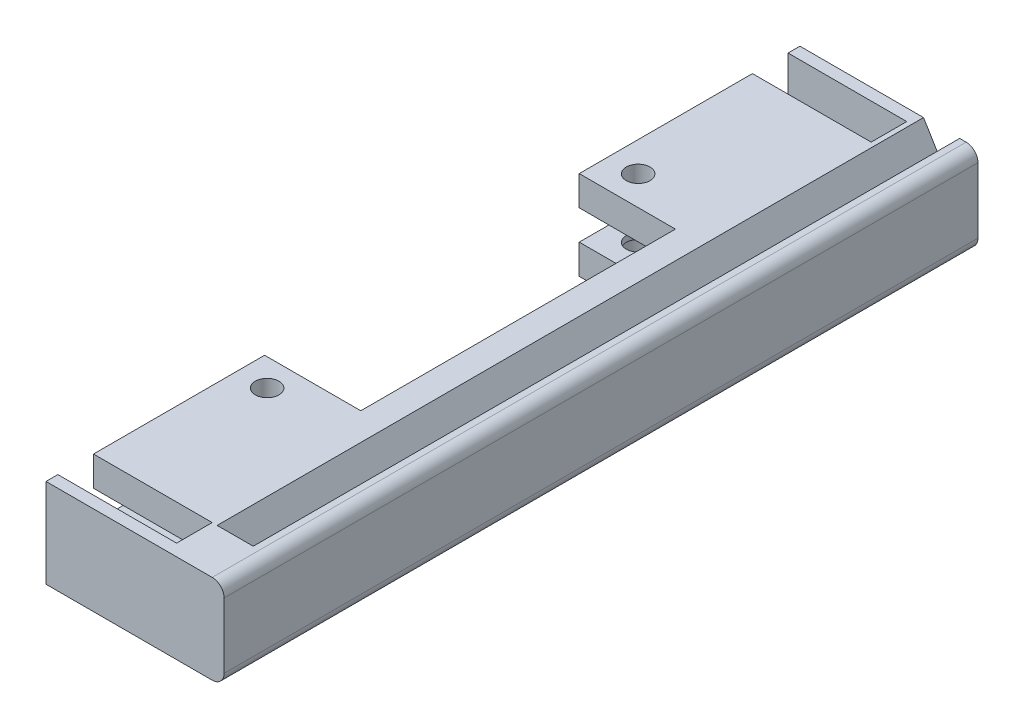
ISO-10303-21;
HEADER;
FILE_DESCRIPTION(('STEP AP214'),'2;1');
FILE_NAME('part.step','',(''),(''),'','','');
FILE_SCHEMA(('AUTOMOTIVE_DESIGN { 1 0 10303 214 1 1 1 1 }'));
ENDSEC;
DATA;
#1=APPLICATION_CONTEXT('core data for automotive mechanical design processes');
#2=APPLICATION_PROTOCOL_DEFINITION('international standard','automotive_design',2000,#1);
#3=PRODUCT_CONTEXT('',#1,'mechanical');
#4=PRODUCT('Part','Part','',(#3));
#5=PRODUCT_RELATED_PRODUCT_CATEGORY('part','',(#4));
#6=PRODUCT_DEFINITION_FORMATION('','',#4);
#7=PRODUCT_DEFINITION_CONTEXT('part definition',#1,'design');
#8=PRODUCT_DEFINITION('design','',#6,#7);
#9=PRODUCT_DEFINITION_SHAPE('','',#8);
#10=(LENGTH_UNIT() NAMED_UNIT(*) SI_UNIT(.MILLI.,.METRE.));
#11=(NAMED_UNIT(*) PLANE_ANGLE_UNIT() SI_UNIT($,.RADIAN.));
#12=(NAMED_UNIT(*) SI_UNIT($,.STERADIAN.) SOLID_ANGLE_UNIT());
#13=UNCERTAINTY_MEASURE_WITH_UNIT(LENGTH_MEASURE(1.E-05),#10,'distance_accuracy_value','');
#14=(GEOMETRIC_REPRESENTATION_CONTEXT(3) GLOBAL_UNCERTAINTY_ASSIGNED_CONTEXT((#13)) GLOBAL_UNIT_ASSIGNED_CONTEXT((#10,
#11,#12)) REPRESENTATION_CONTEXT('',''));
#15=CARTESIAN_POINT('',(0.,0.,0.));
#16=DIRECTION('',(0.,0.,1.));
#17=DIRECTION('',(1.,0.,0.));
#18=AXIS2_PLACEMENT_3D('',#15,#16,#17);
#19=CARTESIAN_POINT('',(0.,0.,111.));
#20=DIRECTION('',(-1.,0.,0.));
#21=DIRECTION('',(0.,0.,1.));
#22=AXIS2_PLACEMENT_3D('',#19,#20,#21);
#23=PLANE('',#22);
#24=DIRECTION('',(0.,-1.,0.));
#25=VECTOR('',#24,1.);
#26=CARTESIAN_POINT('',(0.,20.,82.1749098757519));
#27=LINE('',#26,#25);
#28=CARTESIAN_POINT('',(0.,15.,82.1749098757519));
#29=VERTEX_POINT('',#28);
#30=CARTESIAN_POINT('',(0.,10.,82.1749098757519));
#31=VERTEX_POINT('',#30);
#32=EDGE_CURVE('E279',#29,#31,#27,.T.);
#33=ORIENTED_EDGE('',*,*,#32,.T.);
#34=DIRECTION('',(0.,0.,-1.));
#35=VECTOR('',#34,1.);
#36=CARTESIAN_POINT('',(0.,10.,111.));
#37=LINE('',#36,#35);
#38=CARTESIAN_POINT('',(0.,10.,111.));
#39=VERTEX_POINT('',#38);
#40=EDGE_CURVE('E504',#39,#31,#37,.T.);
#41=ORIENTED_EDGE('',*,*,#40,.F.);
#42=DIRECTION('',(0.,1.,0.));
#43=VECTOR('',#42,1.);
#44=CARTESIAN_POINT('',(0.,0.,111.));
#45=LINE('',#44,#43);
#46=CARTESIAN_POINT('',(0.,15.,111.));
#47=VERTEX_POINT('',#46);
#48=EDGE_CURVE('E461',#39,#47,#45,.T.);
#49=ORIENTED_EDGE('',*,*,#48,.T.);
#50=DIRECTION('',(0.,0.,-1.));
#51=VECTOR('',#50,1.);
#52=CARTESIAN_POINT('',(0.,15.,111.));
#53=LINE('',#52,#51);
#54=EDGE_CURVE('E509',#47,#29,#53,.T.);
#55=ORIENTED_EDGE('',*,*,#54,.T.);
#56=EDGE_LOOP('',(#33,#41,#49,#55));
#57=FACE_BOUND('',#56,.T.);
#58=ADVANCED_FACE('F43',(#57),#23,.T.);
#59=CARTESIAN_POINT('',(0.,0.,111.));
#60=DIRECTION('',(-1.,0.,0.));
#61=DIRECTION('',(0.,0.,1.));
#62=AXIS2_PLACEMENT_3D('',#59,#60,#61);
#63=PLANE('',#62);
#64=CARTESIAN_POINT('',(0.,5.,82.1749098757519));
#65=VERTEX_POINT('',#64);
#66=CARTESIAN_POINT('',(0.,0.,82.1749098757519));
#67=VERTEX_POINT('',#66);
#68=EDGE_CURVE('E275',#65,#67,#27,.T.);
#69=ORIENTED_EDGE('',*,*,#68,.T.);
#70=DIRECTION('',(0.,0.,-1.));
#71=VECTOR('',#70,1.);
#72=CARTESIAN_POINT('',(0.,0.,111.));
#73=LINE('',#72,#71);
#74=CARTESIAN_POINT('',(0.,0.,119.));
#75=VERTEX_POINT('',#74);
#76=EDGE_CURVE('E486',#75,#67,#73,.T.);
#77=ORIENTED_EDGE('',*,*,#76,.F.);
#78=DIRECTION('',(0.,-1.,0.));
#79=VECTOR('',#78,1.);
#80=CARTESIAN_POINT('',(0.,0.,119.));
#81=LINE('',#80,#79);
#82=CARTESIAN_POINT('',(0.,15.,119.));
#83=VERTEX_POINT('',#82);
#84=EDGE_CURVE('E408',#83,#75,#81,.T.);
#85=ORIENTED_EDGE('',*,*,#84,.F.);
#86=DIRECTION('',(0.,0.,-1.));
#87=VECTOR('',#86,1.);
#88=CARTESIAN_POINT('',(0.,15.,119.));
#89=LINE('',#88,#87);
#90=CARTESIAN_POINT('',(0.,15.,117.));
#91=VERTEX_POINT('',#90);
#92=EDGE_CURVE('E432',#83,#91,#89,.T.);
#93=ORIENTED_EDGE('',*,*,#92,.T.);
#94=DIRECTION('',(0.,-1.,0.));
#95=VECTOR('',#94,1.);
#96=CARTESIAN_POINT('',(0.,0.,117.));
#97=LINE('',#96,#95);
#98=CARTESIAN_POINT('',(0.,5.,117.));
#99=VERTEX_POINT('',#98);
#100=EDGE_CURVE('E407',#91,#99,#97,.T.);
#101=ORIENTED_EDGE('',*,*,#100,.T.);
#102=DIRECTION('',(0.,0.,-1.));
#103=VECTOR('',#102,1.);
#104=CARTESIAN_POINT('',(0.,5.,111.));
#105=LINE('',#104,#103);
#106=EDGE_CURVE('E491',#99,#65,#105,.T.);
#107=ORIENTED_EDGE('',*,*,#106,.T.);
#108=EDGE_LOOP('',(#69,#77,#85,#93,#101,#107));
#109=FACE_BOUND('',#108,.T.);
#110=ADVANCED_FACE('F531',(#109),#63,.T.);
#111=CARTESIAN_POINT('',(5.,41.,86.75));
#112=DIRECTION('',(0.,-1.,0.));
#113=DIRECTION('',(0.,0.,-1.));
#114=AXIS2_PLACEMENT_3D('',#111,#112,#113);
#115=CYLINDRICAL_SURFACE('',#114,2.);
#116=CARTESIAN_POINT('',(5.,5.,86.75));
#117=DIRECTION('',(0.,1.,0.));
#118=DIRECTION('',(-1.,0.,0.));
#119=AXIS2_PLACEMENT_3D('',#116,#117,#118);
#120=CIRCLE('',#119,2.);
#121=CARTESIAN_POINT('',(3.,5.,86.75));
#122=VERTEX_POINT('',#121);
#123=EDGE_CURVE('E336',#122,#122,#120,.T.);
#124=ORIENTED_EDGE('',*,*,#123,.T.);
#125=EDGE_LOOP('',(#124));
#126=FACE_BOUND('',#125,.T.);
#127=CARTESIAN_POINT('',(5.,4.,86.75));
#128=DIRECTION('',(0.,-1.,0.));
#129=DIRECTION('',(0.,0.,-1.));
#130=AXIS2_PLACEMENT_3D('',#127,#128,#129);
#131=CIRCLE('',#130,2.);
#132=CARTESIAN_POINT('',(5.,4.,84.75));
#133=VERTEX_POINT('',#132);
#134=EDGE_CURVE('E47',#133,#133,#131,.F.);
#135=ORIENTED_EDGE('',*,*,#134,.F.);
#136=EDGE_LOOP('',(#135));
#137=FACE_BOUND('',#136,.T.);
#138=ADVANCED_FACE('F528',(#126,#137),#115,.F.);
#139=CARTESIAN_POINT('',(5.,41.,24.25));
#140=DIRECTION('',(0.,-1.,0.));
#141=DIRECTION('',(0.,0.,-1.));
#142=AXIS2_PLACEMENT_3D('',#139,#140,#141);
#143=CYLINDRICAL_SURFACE('',#142,2.);
#144=CARTESIAN_POINT('',(5.,5.,24.25));
#145=DIRECTION('',(0.,1.,0.));
#146=DIRECTION('',(-1.,0.,0.));
#147=AXIS2_PLACEMENT_3D('',#144,#145,#146);
#148=CIRCLE('',#147,2.);
#149=CARTESIAN_POINT('',(3.,5.,24.25));
#150=VERTEX_POINT('',#149);
#151=EDGE_CURVE('E348',#150,#150,#148,.T.);
#152=ORIENTED_EDGE('',*,*,#151,.T.);
#153=EDGE_LOOP('',(#152));
#154=FACE_BOUND('',#153,.T.);
#155=CARTESIAN_POINT('',(5.,4.,24.25));
#156=DIRECTION('',(0.,-1.,0.));
#157=DIRECTION('',(0.,0.,-1.));
#158=AXIS2_PLACEMENT_3D('',#155,#156,#157);
#159=CIRCLE('',#158,2.);
#160=CARTESIAN_POINT('',(5.,4.,22.25));
#161=VERTEX_POINT('',#160);
#162=EDGE_CURVE('E324',#161,#161,#159,.F.);
#163=ORIENTED_EDGE('',*,*,#162,.F.);
#164=EDGE_LOOP('',(#163));
#165=FACE_BOUND('',#164,.T.);
#166=ADVANCED_FACE('F530',(#154,#165),#143,.F.);
#167=CARTESIAN_POINT('',(0.,0.,0.));
#168=DIRECTION('',(0.,0.,1.));
#169=DIRECTION('',(1.,0.,0.));
#170=AXIS2_PLACEMENT_3D('',#167,#168,#169);
#171=PLANE('',#170);
#172=DIRECTION('',(0.,1.,0.));
#173=VECTOR('',#172,1.);
#174=CARTESIAN_POINT('',(20.,0.,0.));
#175=LINE('',#174,#173);
#176=CARTESIAN_POINT('',(20.,10.,0.));
#177=VERTEX_POINT('',#176);
#178=CARTESIAN_POINT('',(20.,15.,0.));
#179=VERTEX_POINT('',#178);
#180=EDGE_CURVE('E11',#177,#179,#175,.T.);
#181=ORIENTED_EDGE('',*,*,#180,.F.);
#182=DIRECTION('',(1.,0.,0.));
#183=VECTOR('',#182,1.);
#184=CARTESIAN_POINT('',(0.,10.,0.));
#185=LINE('',#184,#183);
#186=CARTESIAN_POINT('',(0.,10.,0.));
#187=VERTEX_POINT('',#186);
#188=EDGE_CURVE('E462',#187,#177,#185,.T.);
#189=ORIENTED_EDGE('',*,*,#188,.F.);
#190=DIRECTION('',(0.,1.,0.));
#191=VECTOR('',#190,1.);
#192=CARTESIAN_POINT('',(0.,0.,0.));
#193=LINE('',#192,#191);
#194=CARTESIAN_POINT('',(0.,15.,0.));
#195=VERTEX_POINT('',#194);
#196=EDGE_CURVE('E473',#187,#195,#193,.T.);
#197=ORIENTED_EDGE('',*,*,#196,.T.);
#198=DIRECTION('',(1.,0.,0.));
#199=VECTOR('',#198,1.);
#200=CARTESIAN_POINT('',(0.,15.,0.));
#201=LINE('',#200,#199);
#202=EDGE_CURVE('E456',#195,#179,#201,.T.);
#203=ORIENTED_EDGE('',*,*,#202,.T.);
#204=EDGE_LOOP('',(#181,#189,#197,#203));
#205=FACE_BOUND('',#204,.T.);
#206=ADVANCED_FACE('F539',(#205),#171,.F.);
#207=CARTESIAN_POINT('',(0.,0.,111.));
#208=DIRECTION('',(0.,0.,1.));
#209=DIRECTION('',(1.,0.,0.));
#210=AXIS2_PLACEMENT_3D('',#207,#208,#209);
#211=PLANE('',#210);
#212=DIRECTION('',(1.,0.,0.));
#213=VECTOR('',#212,1.);
#214=CARTESIAN_POINT('',(0.,10.,111.));
#215=LINE('',#214,#213);
#216=CARTESIAN_POINT('',(20.,10.,111.));
#217=VERTEX_POINT('',#216);
#218=EDGE_CURVE('E466',#39,#217,#215,.T.);
#219=ORIENTED_EDGE('',*,*,#218,.T.);
#220=DIRECTION('',(0.,1.,0.));
#221=VECTOR('',#220,1.);
#222=CARTESIAN_POINT('',(20.,0.,111.));
#223=LINE('',#222,#221);
#224=CARTESIAN_POINT('',(20.,15.,111.));
#225=VERTEX_POINT('',#224);
#226=EDGE_CURVE('E53',#217,#225,#223,.T.);
#227=ORIENTED_EDGE('',*,*,#226,.T.);
#228=DIRECTION('',(1.,0.,0.));
#229=VECTOR('',#228,1.);
#230=CARTESIAN_POINT('',(0.,15.,111.));
#231=LINE('',#230,#229);
#232=EDGE_CURVE('E457',#47,#225,#231,.T.);
#233=ORIENTED_EDGE('',*,*,#232,.F.);
#234=ORIENTED_EDGE('',*,*,#48,.F.);
#235=EDGE_LOOP('',(#219,#227,#233,#234));
#236=FACE_BOUND('',#235,.T.);
#237=ADVANCED_FACE('F689',(#236),#211,.T.);
#238=CARTESIAN_POINT('',(30.,0.,111.));
#239=DIRECTION('',(1.,0.,0.));
#240=DIRECTION('',(0.,0.,-1.));
#241=AXIS2_PLACEMENT_3D('',#238,#239,#240);
#242=PLANE('',#241);
#243=DIRECTION('',(0.,0.,-1.));
#244=VECTOR('',#243,1.);
#245=CARTESIAN_POINT('',(30.,2.,111.));
#246=LINE('',#245,#244);
#247=CARTESIAN_POINT('',(30.,2.,119.));
#248=VERTEX_POINT('',#247);
#249=CARTESIAN_POINT('',(30.,2.,-8.));
#250=VERTEX_POINT('',#249);
#251=EDGE_CURVE('E470',#248,#250,#246,.T.);
#252=ORIENTED_EDGE('',*,*,#251,.T.);
#253=DIRECTION('',(0.,-1.,0.));
#254=VECTOR('',#253,1.);
#255=CARTESIAN_POINT('',(30.,0.,-8.));
#256=LINE('',#255,#254);
#257=CARTESIAN_POINT('',(30.,13.,-8.));
#258=VERTEX_POINT('',#257);
#259=EDGE_CURVE('E370',#258,#250,#256,.T.);
#260=ORIENTED_EDGE('',*,*,#259,.F.);
#261=DIRECTION('',(0.,0.,-1.));
#262=VECTOR('',#261,1.);
#263=CARTESIAN_POINT('',(30.,13.,111.));
#264=LINE('',#263,#262);
#265=CARTESIAN_POINT('',(30.,13.,119.));
#266=VERTEX_POINT('',#265);
#267=EDGE_CURVE('E453',#266,#258,#264,.T.);
#268=ORIENTED_EDGE('',*,*,#267,.F.);
#269=DIRECTION('',(0.,1.,0.));
#270=VECTOR('',#269,1.);
#271=CARTESIAN_POINT('',(30.,0.,119.));
#272=LINE('',#271,#270);
#273=EDGE_CURVE('E421',#248,#266,#272,.T.);
#274=ORIENTED_EDGE('',*,*,#273,.F.);
#275=EDGE_LOOP('',(#252,#260,#268,#274));
#276=FACE_BOUND('',#275,.T.);
#277=ADVANCED_FACE('F45',(#276),#242,.T.);
#278=CARTESIAN_POINT('',(28.,13.,111.));
#279=DIRECTION('',(0.,0.,-1.));
#280=DIRECTION('',(-1.,0.,0.));
#281=AXIS2_PLACEMENT_3D('',#278,#279,#280);
#282=CYLINDRICAL_SURFACE('',#281,2.);
#283=ORIENTED_EDGE('',*,*,#267,.T.);
#284=CARTESIAN_POINT('',(28.,13.,-8.));
#285=DIRECTION('',(0.,0.,-1.));
#286=DIRECTION('',(-1.,0.,0.));
#287=AXIS2_PLACEMENT_3D('',#284,#285,#286);
#288=CIRCLE('',#287,2.);
#289=CARTESIAN_POINT('',(28.,15.,-8.));
#290=VERTEX_POINT('',#289);
#291=EDGE_CURVE('E365',#290,#258,#288,.T.);
#292=ORIENTED_EDGE('',*,*,#291,.F.);
#293=DIRECTION('',(0.,0.,-1.));
#294=VECTOR('',#293,1.);
#295=CARTESIAN_POINT('',(28.,15.,111.));
#296=LINE('',#295,#294);
#297=CARTESIAN_POINT('',(28.,15.,119.));
#298=VERTEX_POINT('',#297);
#299=EDGE_CURVE('E513',#298,#290,#296,.T.);
#300=ORIENTED_EDGE('',*,*,#299,.F.);
#301=CARTESIAN_POINT('',(28.,13.,119.));
#302=DIRECTION('',(0.,0.,1.));
#303=DIRECTION('',(1.,0.,0.));
#304=AXIS2_PLACEMENT_3D('',#301,#302,#303);
#305=CIRCLE('',#304,2.);
#306=EDGE_CURVE('E425',#266,#298,#305,.T.);
#307=ORIENTED_EDGE('',*,*,#306,.F.);
#308=EDGE_LOOP('',(#283,#292,#300,#307));
#309=FACE_BOUND('',#308,.T.);
#310=ADVANCED_FACE('F569',(#309),#282,.T.);
#311=CARTESIAN_POINT('',(0.,15.,111.));
#312=DIRECTION('',(0.,1.,0.));
#313=DIRECTION('',(0.,0.,1.));
#314=AXIS2_PLACEMENT_3D('',#311,#312,#313);
#315=PLANE('',#314);
#316=DIRECTION('',(0.,0.,-1.));
#317=VECTOR('',#316,1.);
#318=CARTESIAN_POINT('',(26.9106386641128,15.,120.14136495072));
#319=LINE('',#318,#317);
#320=CARTESIAN_POINT('',(26.9106386641128,15.,111.));
#321=VERTEX_POINT('',#320);
#322=CARTESIAN_POINT('',(26.9106386641128,15.,-8.));
#323=VERTEX_POINT('',#322);
#324=EDGE_CURVE('E251',#321,#323,#319,.T.);
#325=ORIENTED_EDGE('',*,*,#324,.F.);
#326=DIRECTION('',(1.,0.,0.));
#327=VECTOR('',#326,1.);
#328=CARTESIAN_POINT('',(20.8273521159874,15.,111.));
#329=LINE('',#328,#327);
#330=CARTESIAN_POINT('',(20.8273521159874,15.,111.));
#331=VERTEX_POINT('',#330);
#332=EDGE_CURVE('E239',#331,#321,#329,.T.);
#333=ORIENTED_EDGE('',*,*,#332,.F.);
#334=DIRECTION('',(0.,0.,-1.));
#335=VECTOR('',#334,1.);
#336=CARTESIAN_POINT('',(20.8273521159874,15.,120.14136495072));
#337=LINE('',#336,#335);
#338=CARTESIAN_POINT('',(20.8273521159874,15.,-8.));
#339=VERTEX_POINT('',#338);
#340=EDGE_CURVE('E252',#331,#339,#337,.T.);
#341=ORIENTED_EDGE('',*,*,#340,.T.);
#342=DIRECTION('',(1.,0.,0.));
#343=VECTOR('',#342,1.);
#344=CARTESIAN_POINT('',(0.,15.,-8.));
#345=LINE('',#344,#343);
#346=CARTESIAN_POINT('',(0.,15.,-8.));
#347=VERTEX_POINT('',#346);
#348=EDGE_CURVE('E361',#347,#339,#345,.T.);
#349=ORIENTED_EDGE('',*,*,#348,.F.);
#350=DIRECTION('',(0.,0.,1.));
#351=VECTOR('',#350,1.);
#352=CARTESIAN_POINT('',(0.,15.,-8.));
#353=LINE('',#352,#351);
#354=CARTESIAN_POINT('',(0.,15.,-6.));
#355=VERTEX_POINT('',#354);
#356=EDGE_CURVE('E385',#347,#355,#353,.T.);
#357=ORIENTED_EDGE('',*,*,#356,.T.);
#358=DIRECTION('',(1.,0.,0.));
#359=VECTOR('',#358,1.);
#360=CARTESIAN_POINT('',(0.,15.,-6.));
#361=LINE('',#360,#359);
#362=CARTESIAN_POINT('',(20.,15.,-6.));
#363=VERTEX_POINT('',#362);
#364=EDGE_CURVE('E360',#355,#363,#361,.T.);
#365=ORIENTED_EDGE('',*,*,#364,.T.);
#366=DIRECTION('',(0.,0.,1.));
#367=VECTOR('',#366,1.);
#368=CARTESIAN_POINT('',(20.,15.,-6.));
#369=LINE('',#368,#367);
#370=EDGE_CURVE('E402',#363,#179,#369,.T.);
#371=ORIENTED_EDGE('',*,*,#370,.T.);
#372=ORIENTED_EDGE('',*,*,#202,.F.);
#373=CARTESIAN_POINT('',(0.,15.,29.1749098757519));
#374=VERTEX_POINT('',#373);
#375=EDGE_CURVE('E508',#374,#195,#53,.T.);
#376=ORIENTED_EDGE('',*,*,#375,.F.);
#377=DIRECTION('',(-1.,0.,0.));
#378=VECTOR('',#377,1.);
#379=CARTESIAN_POINT('',(0.,15.,29.1749098757519));
#380=LINE('',#379,#378);
#381=CARTESIAN_POINT('',(16.2,15.,29.1749098757519));
#382=VERTEX_POINT('',#381);
#383=EDGE_CURVE('E296',#382,#374,#380,.T.);
#384=ORIENTED_EDGE('',*,*,#383,.F.);
#385=DIRECTION('',(0.,0.,-1.));
#386=VECTOR('',#385,1.);
#387=CARTESIAN_POINT('',(16.2,15.,111.));
#388=LINE('',#387,#386);
#389=CARTESIAN_POINT('',(16.2,15.,82.1749098757519));
#390=VERTEX_POINT('',#389);
#391=EDGE_CURVE('E306',#390,#382,#388,.T.);
#392=ORIENTED_EDGE('',*,*,#391,.F.);
#393=DIRECTION('',(1.,0.,0.));
#394=VECTOR('',#393,1.);
#395=CARTESIAN_POINT('',(0.,15.,82.1749098757519));
#396=LINE('',#395,#394);
#397=EDGE_CURVE('E316',#29,#390,#396,.T.);
#398=ORIENTED_EDGE('',*,*,#397,.F.);
#399=ORIENTED_EDGE('',*,*,#54,.F.);
#400=ORIENTED_EDGE('',*,*,#232,.T.);
#401=DIRECTION('',(0.,0.,-1.));
#402=VECTOR('',#401,1.);
#403=CARTESIAN_POINT('',(20.,15.,117.));
#404=LINE('',#403,#402);
#405=CARTESIAN_POINT('',(20.,15.,117.));
#406=VERTEX_POINT('',#405);
#407=EDGE_CURVE('E449',#406,#225,#404,.T.);
#408=ORIENTED_EDGE('',*,*,#407,.F.);
#409=DIRECTION('',(-1.,0.,0.));
#410=VECTOR('',#409,1.);
#411=CARTESIAN_POINT('',(0.,15.,117.));
#412=LINE('',#411,#410);
#413=EDGE_CURVE('E413',#406,#91,#412,.T.);
#414=ORIENTED_EDGE('',*,*,#413,.T.);
#415=ORIENTED_EDGE('',*,*,#92,.F.);
#416=DIRECTION('',(-1.,0.,0.));
#417=VECTOR('',#416,1.);
#418=CARTESIAN_POINT('',(0.,15.,119.));
#419=LINE('',#418,#417);
#420=EDGE_CURVE('E429',#298,#83,#419,.T.);
#421=ORIENTED_EDGE('',*,*,#420,.F.);
#422=ORIENTED_EDGE('',*,*,#299,.T.);
#423=EDGE_CURVE('E366',#323,#290,#345,.T.);
#424=ORIENTED_EDGE('',*,*,#423,.F.);
#425=EDGE_LOOP('',(#325,#333,#341,#349,#357,#365,#371,#372,#376,#384,#392,#398,#399,#400,#408,
#414,#415,#421,#422,#424));
#426=FACE_BOUND('',#425,.T.);
#427=CARTESIAN_POINT('',(5.,15.,24.25));
#428=DIRECTION('',(0.,1.,0.));
#429=DIRECTION('',(0.,0.,1.));
#430=AXIS2_PLACEMENT_3D('',#427,#428,#429);
#431=CIRCLE('',#430,2.);
#432=CARTESIAN_POINT('',(5.,15.,26.25));
#433=VERTEX_POINT('',#432);
#434=EDGE_CURVE('E356',#433,#433,#431,.T.);
#435=ORIENTED_EDGE('',*,*,#434,.F.);
#436=EDGE_LOOP('',(#435));
#437=FACE_BOUND('',#436,.T.);
#438=CARTESIAN_POINT('',(5.,15.,86.75));
#439=DIRECTION('',(0.,1.,0.));
#440=DIRECTION('',(0.,0.,1.));
#441=AXIS2_PLACEMENT_3D('',#438,#439,#440);
#442=CIRCLE('',#441,2.);
#443=CARTESIAN_POINT('',(5.,15.,88.75));
#444=VERTEX_POINT('',#443);
#445=EDGE_CURVE('E344',#444,#444,#442,.T.);
#446=ORIENTED_EDGE('',*,*,#445,.F.);
#447=EDGE_LOOP('',(#446));
#448=FACE_BOUND('',#447,.T.);
#449=ADVANCED_FACE('F561',(#426,#437,#448),#315,.T.);
#450=DIRECTION('',(0.,-1.,0.));
#451=VECTOR('',#450,1.);
#452=CARTESIAN_POINT('',(0.,20.,29.1749098757519));
#453=LINE('',#452,#451);
#454=CARTESIAN_POINT('',(0.,10.,29.1749098757519));
#455=VERTEX_POINT('',#454);
#456=EDGE_CURVE('E69',#374,#455,#453,.T.);
#457=ORIENTED_EDGE('',*,*,#456,.F.);
#458=ORIENTED_EDGE('',*,*,#375,.T.);
#459=ORIENTED_EDGE('',*,*,#196,.F.);
#460=EDGE_CURVE('E503',#455,#187,#37,.T.);
#461=ORIENTED_EDGE('',*,*,#460,.F.);
#462=EDGE_LOOP('',(#457,#458,#459,#461));
#463=FACE_BOUND('',#462,.T.);
#464=ADVANCED_FACE('F553',(#463),#23,.T.);
#465=CARTESIAN_POINT('',(0.,10.,111.));
#466=DIRECTION('',(0.,1.,0.));
#467=DIRECTION('',(0.,0.,1.));
#468=AXIS2_PLACEMENT_3D('',#465,#466,#467);
#469=PLANE('',#468);
#470=CARTESIAN_POINT('',(5.,10.,24.25));
#471=DIRECTION('',(0.,1.,0.));
#472=DIRECTION('',(0.,0.,1.));
#473=AXIS2_PLACEMENT_3D('',#470,#471,#472);
#474=CIRCLE('',#473,2.);
#475=CARTESIAN_POINT('',(5.,10.,26.25));
#476=VERTEX_POINT('',#475);
#477=EDGE_CURVE('E352',#476,#476,#474,.T.);
#478=ORIENTED_EDGE('',*,*,#477,.T.);
#479=EDGE_LOOP('',(#478));
#480=FACE_BOUND('',#479,.T.);
#481=CARTESIAN_POINT('',(5.,10.,86.75));
#482=DIRECTION('',(0.,1.,0.));
#483=DIRECTION('',(0.,0.,1.));
#484=AXIS2_PLACEMENT_3D('',#481,#482,#483);
#485=CIRCLE('',#484,2.);
#486=CARTESIAN_POINT('',(5.,10.,88.75));
#487=VERTEX_POINT('',#486);
#488=EDGE_CURVE('E340',#487,#487,#485,.T.);
#489=ORIENTED_EDGE('',*,*,#488,.T.);
#490=EDGE_LOOP('',(#489));
#491=FACE_BOUND('',#490,.T.);
#492=ORIENTED_EDGE('',*,*,#40,.T.);
#493=DIRECTION('',(1.,0.,0.));
#494=VECTOR('',#493,1.);
#495=CARTESIAN_POINT('',(0.,10.,82.1749098757519));
#496=LINE('',#495,#494);
#497=CARTESIAN_POINT('',(16.2,10.,82.1749098757519));
#498=VERTEX_POINT('',#497);
#499=EDGE_CURVE('E312',#31,#498,#496,.T.);
#500=ORIENTED_EDGE('',*,*,#499,.T.);
#501=DIRECTION('',(0.,0.,-1.));
#502=VECTOR('',#501,1.);
#503=CARTESIAN_POINT('',(16.2,10.,111.));
#504=LINE('',#503,#502);
#505=CARTESIAN_POINT('',(16.2,10.,29.1749098757519));
#506=VERTEX_POINT('',#505);
#507=EDGE_CURVE('E302',#498,#506,#504,.T.);
#508=ORIENTED_EDGE('',*,*,#507,.T.);
#509=DIRECTION('',(-1.,0.,0.));
#510=VECTOR('',#509,1.);
#511=CARTESIAN_POINT('',(0.,10.,29.1749098757519));
#512=LINE('',#511,#510);
#513=EDGE_CURVE('E293',#506,#455,#512,.T.);
#514=ORIENTED_EDGE('',*,*,#513,.T.);
#515=ORIENTED_EDGE('',*,*,#460,.T.);
#516=ORIENTED_EDGE('',*,*,#188,.T.);
#517=DIRECTION('',(0.,0.,-1.));
#518=VECTOR('',#517,1.);
#519=CARTESIAN_POINT('',(20.,10.,111.));
#520=LINE('',#519,#518);
#521=EDGE_CURVE('E499',#217,#177,#520,.T.);
#522=ORIENTED_EDGE('',*,*,#521,.F.);
#523=ORIENTED_EDGE('',*,*,#218,.F.);
#524=EDGE_LOOP('',(#492,#500,#508,#514,#515,#516,#522,#523));
#525=FACE_BOUND('',#524,.T.);
#526=ADVANCED_FACE('F560',(#480,#491,#525),#469,.F.);
#527=CARTESIAN_POINT('',(20.,0.,111.));
#528=DIRECTION('',(1.,0.,0.));
#529=DIRECTION('',(0.,0.,-1.));
#530=AXIS2_PLACEMENT_3D('',#527,#528,#529);
#531=PLANE('',#530);
#532=ORIENTED_EDGE('',*,*,#521,.T.);
#533=ORIENTED_EDGE('',*,*,#180,.T.);
#534=ORIENTED_EDGE('',*,*,#370,.F.);
#535=DIRECTION('',(0.,1.,0.));
#536=VECTOR('',#535,1.);
#537=CARTESIAN_POINT('',(20.,0.,-6.));
#538=LINE('',#537,#536);
#539=CARTESIAN_POINT('',(20.,5.,-6.));
#540=VERTEX_POINT('',#539);
#541=EDGE_CURVE('E395',#540,#363,#538,.T.);
#542=ORIENTED_EDGE('',*,*,#541,.F.);
#543=DIRECTION('',(0.,0.,-1.));
#544=VECTOR('',#543,1.);
#545=CARTESIAN_POINT('',(20.,5.,111.));
#546=LINE('',#545,#544);
#547=CARTESIAN_POINT('',(20.,5.,117.));
#548=VERTEX_POINT('',#547);
#549=EDGE_CURVE('E495',#548,#540,#546,.T.);
#550=ORIENTED_EDGE('',*,*,#549,.F.);
#551=DIRECTION('',(0.,1.,0.));
#552=VECTOR('',#551,1.);
#553=CARTESIAN_POINT('',(20.,0.,117.));
#554=LINE('',#553,#552);
#555=EDGE_CURVE('E441',#548,#406,#554,.T.);
#556=ORIENTED_EDGE('',*,*,#555,.T.);
#557=ORIENTED_EDGE('',*,*,#407,.T.);
#558=ORIENTED_EDGE('',*,*,#226,.F.);
#559=EDGE_LOOP('',(#532,#533,#534,#542,#550,#556,#557,#558));
#560=FACE_BOUND('',#559,.T.);
#561=ADVANCED_FACE('F567',(#560),#531,.F.);
#562=CARTESIAN_POINT('',(0.,5.,111.));
#563=DIRECTION('',(0.,1.,0.));
#564=DIRECTION('',(-1.,0.,0.));
#565=AXIS2_PLACEMENT_3D('',#562,#563,#564);
#566=PLANE('',#565);
#567=DIRECTION('',(1.,0.,0.));
#568=VECTOR('',#567,1.);
#569=CARTESIAN_POINT('',(0.,5.,82.1749098757519));
#570=LINE('',#569,#568);
#571=CARTESIAN_POINT('',(16.2,5.,82.1749098757519));
#572=VERTEX_POINT('',#571);
#573=EDGE_CURVE('E309',#65,#572,#570,.T.);
#574=ORIENTED_EDGE('',*,*,#573,.F.);
#575=ORIENTED_EDGE('',*,*,#106,.F.);
#576=DIRECTION('',(-1.,0.,0.));
#577=VECTOR('',#576,1.);
#578=CARTESIAN_POINT('',(0.,5.,117.));
#579=LINE('',#578,#577);
#580=EDGE_CURVE('E445',#548,#99,#579,.T.);
#581=ORIENTED_EDGE('',*,*,#580,.F.);
#582=ORIENTED_EDGE('',*,*,#549,.T.);
#583=DIRECTION('',(1.,0.,0.));
#584=VECTOR('',#583,1.);
#585=CARTESIAN_POINT('',(0.,5.,-6.));
#586=LINE('',#585,#584);
#587=CARTESIAN_POINT('',(0.,5.,-6.));
#588=VERTEX_POINT('',#587);
#589=EDGE_CURVE('E399',#588,#540,#586,.T.);
#590=ORIENTED_EDGE('',*,*,#589,.F.);
#591=CARTESIAN_POINT('',(0.,5.,29.1749098757519));
#592=VERTEX_POINT('',#591);
#593=EDGE_CURVE('E490',#592,#588,#105,.T.);
#594=ORIENTED_EDGE('',*,*,#593,.F.);
#595=DIRECTION('',(-1.,0.,0.));
#596=VECTOR('',#595,1.);
#597=CARTESIAN_POINT('',(0.,5.,29.1749098757519));
#598=LINE('',#597,#596);
#599=CARTESIAN_POINT('',(16.2,5.,29.1749098757519));
#600=VERTEX_POINT('',#599);
#601=EDGE_CURVE('E290',#600,#592,#598,.T.);
#602=ORIENTED_EDGE('',*,*,#601,.F.);
#603=DIRECTION('',(0.,0.,-1.));
#604=VECTOR('',#603,1.);
#605=CARTESIAN_POINT('',(16.2,5.,111.));
#606=LINE('',#605,#604);
#607=EDGE_CURVE('E299',#572,#600,#606,.T.);
#608=ORIENTED_EDGE('',*,*,#607,.F.);
#609=EDGE_LOOP('',(#574,#575,#581,#582,#590,#594,#602,#608));
#610=FACE_BOUND('',#609,.T.);
#611=ORIENTED_EDGE('',*,*,#151,.F.);
#612=EDGE_LOOP('',(#611));
#613=FACE_BOUND('',#612,.T.);
#614=ORIENTED_EDGE('',*,*,#123,.F.);
#615=EDGE_LOOP('',(#614));
#616=FACE_BOUND('',#615,.T.);
#617=ADVANCED_FACE('F671',(#610,#613,#616),#566,.T.);
#618=CARTESIAN_POINT('',(0.,0.,29.1749098757519));
#619=VERTEX_POINT('',#618);
#620=EDGE_CURVE('E274',#592,#619,#453,.T.);
#621=ORIENTED_EDGE('',*,*,#620,.F.);
#622=ORIENTED_EDGE('',*,*,#593,.T.);
#623=DIRECTION('',(0.,1.,0.));
#624=VECTOR('',#623,1.);
#625=CARTESIAN_POINT('',(0.,0.,-6.));
#626=LINE('',#625,#624);
#627=EDGE_CURVE('E389',#588,#355,#626,.T.);
#628=ORIENTED_EDGE('',*,*,#627,.T.);
#629=ORIENTED_EDGE('',*,*,#356,.F.);
#630=DIRECTION('',(0.,1.,0.));
#631=VECTOR('',#630,1.);
#632=CARTESIAN_POINT('',(0.,0.,-8.));
#633=LINE('',#632,#631);
#634=CARTESIAN_POINT('',(0.,0.,-8.));
#635=VERTEX_POINT('',#634);
#636=EDGE_CURVE('E382',#635,#347,#633,.T.);
#637=ORIENTED_EDGE('',*,*,#636,.F.);
#638=EDGE_CURVE('E485',#619,#635,#73,.T.);
#639=ORIENTED_EDGE('',*,*,#638,.F.);
#640=EDGE_LOOP('',(#621,#622,#628,#629,#637,#639));
#641=FACE_BOUND('',#640,.T.);
#642=ADVANCED_FACE('F545',(#641),#63,.T.);
#643=CARTESIAN_POINT('',(0.,0.,111.));
#644=DIRECTION('',(0.,1.,0.));
#645=DIRECTION('',(0.,0.,1.));
#646=AXIS2_PLACEMENT_3D('',#643,#644,#645);
#647=PLANE('',#646);
#648=CARTESIAN_POINT('',(5.,0.,24.25));
#649=DIRECTION('',(0.,-1.,0.));
#650=DIRECTION('',(0.,0.,-1.));
#651=AXIS2_PLACEMENT_3D('',#648,#649,#650);
#652=CIRCLE('',#651,4.);
#653=CARTESIAN_POINT('',(5.,0.,20.25));
#654=VERTEX_POINT('',#653);
#655=EDGE_CURVE('E325',#654,#654,#652,.T.);
#656=ORIENTED_EDGE('',*,*,#655,.F.);
#657=EDGE_LOOP('',(#656));
#658=FACE_BOUND('',#657,.T.);
#659=CARTESIAN_POINT('',(5.,0.,86.75));
#660=DIRECTION('',(0.,-1.,0.));
#661=DIRECTION('',(0.,0.,-1.));
#662=AXIS2_PLACEMENT_3D('',#659,#660,#661);
#663=CIRCLE('',#662,4.00000000000001);
#664=CARTESIAN_POINT('',(5.,0.,82.75));
#665=VERTEX_POINT('',#664);
#666=EDGE_CURVE('E319',#665,#665,#663,.T.);
#667=ORIENTED_EDGE('',*,*,#666,.F.);
#668=EDGE_LOOP('',(#667));
#669=FACE_BOUND('',#668,.T.);
#670=ORIENTED_EDGE('',*,*,#76,.T.);
#671=DIRECTION('',(-1.,0.,0.));
#672=VECTOR('',#671,1.);
#673=CARTESIAN_POINT('',(0.,0.,82.1749098757519));
#674=LINE('',#673,#672);
#675=CARTESIAN_POINT('',(16.2,0.,82.1749098757519));
#676=VERTEX_POINT('',#675);
#677=EDGE_CURVE('E271',#676,#67,#674,.T.);
#678=ORIENTED_EDGE('',*,*,#677,.F.);
#679=DIRECTION('',(0.,0.,1.));
#680=VECTOR('',#679,1.);
#681=CARTESIAN_POINT('',(16.2,0.,29.1749098757519));
#682=LINE('',#681,#680);
#683=CARTESIAN_POINT('',(16.2,0.,29.1749098757519));
#684=VERTEX_POINT('',#683);
#685=EDGE_CURVE('E267',#684,#676,#682,.T.);
#686=ORIENTED_EDGE('',*,*,#685,.F.);
#687=DIRECTION('',(1.,0.,0.));
#688=VECTOR('',#687,1.);
#689=CARTESIAN_POINT('',(0.,0.,29.1749098757519));
#690=LINE('',#689,#688);
#691=EDGE_CURVE('E263',#619,#684,#690,.T.);
#692=ORIENTED_EDGE('',*,*,#691,.F.);
#693=ORIENTED_EDGE('',*,*,#638,.T.);
#694=DIRECTION('',(-1.,0.,0.));
#695=VECTOR('',#694,1.);
#696=CARTESIAN_POINT('',(0.,0.,-8.));
#697=LINE('',#696,#695);
#698=CARTESIAN_POINT('',(28.,0.,-8.));
#699=VERTEX_POINT('',#698);
#700=EDGE_CURVE('E378',#699,#635,#697,.T.);
#701=ORIENTED_EDGE('',*,*,#700,.F.);
#702=DIRECTION('',(0.,0.,-1.));
#703=VECTOR('',#702,1.);
#704=CARTESIAN_POINT('',(28.,0.,111.));
#705=LINE('',#704,#703);
#706=CARTESIAN_POINT('',(28.,0.,119.));
#707=VERTEX_POINT('',#706);
#708=EDGE_CURVE('E482',#707,#699,#705,.T.);
#709=ORIENTED_EDGE('',*,*,#708,.F.);
#710=DIRECTION('',(1.,0.,0.));
#711=VECTOR('',#710,1.);
#712=CARTESIAN_POINT('',(0.,0.,119.));
#713=LINE('',#712,#711);
#714=EDGE_CURVE('E412',#75,#707,#713,.T.);
#715=ORIENTED_EDGE('',*,*,#714,.F.);
#716=EDGE_LOOP('',(#670,#678,#686,#692,#693,#701,#709,#715));
#717=FACE_BOUND('',#716,.T.);
#718=ADVANCED_FACE('F604',(#658,#669,#717),#647,.F.);
#719=CARTESIAN_POINT('',(28.,2.,111.));
#720=DIRECTION('',(0.,0.,-1.));
#721=DIRECTION('',(-1.,0.,0.));
#722=AXIS2_PLACEMENT_3D('',#719,#720,#721);
#723=CYLINDRICAL_SURFACE('',#722,2.);
#724=ORIENTED_EDGE('',*,*,#708,.T.);
#725=CARTESIAN_POINT('',(28.,2.,-8.));
#726=DIRECTION('',(0.,0.,-1.));
#727=DIRECTION('',(-1.,0.,0.));
#728=AXIS2_PLACEMENT_3D('',#725,#726,#727);
#729=CIRCLE('',#728,2.);
#730=EDGE_CURVE('E374',#250,#699,#729,.T.);
#731=ORIENTED_EDGE('',*,*,#730,.F.);
#732=ORIENTED_EDGE('',*,*,#251,.F.);
#733=CARTESIAN_POINT('',(28.,2.,119.));
#734=DIRECTION('',(0.,0.,1.));
#735=DIRECTION('',(1.,0.,0.));
#736=AXIS2_PLACEMENT_3D('',#733,#734,#735);
#737=CIRCLE('',#736,2.);
#738=EDGE_CURVE('E417',#707,#248,#737,.T.);
#739=ORIENTED_EDGE('',*,*,#738,.F.);
#740=EDGE_LOOP('',(#724,#731,#732,#739));
#741=FACE_BOUND('',#740,.T.);
#742=ADVANCED_FACE('F599',(#741),#723,.T.);
#743=CARTESIAN_POINT('',(0.,0.,119.));
#744=DIRECTION('',(0.,0.,1.));
#745=DIRECTION('',(1.,0.,0.));
#746=AXIS2_PLACEMENT_3D('',#743,#744,#745);
#747=PLANE('',#746);
#748=ORIENTED_EDGE('',*,*,#84,.T.);
#749=ORIENTED_EDGE('',*,*,#714,.T.);
#750=ORIENTED_EDGE('',*,*,#738,.T.);
#751=ORIENTED_EDGE('',*,*,#273,.T.);
#752=ORIENTED_EDGE('',*,*,#306,.T.);
#753=ORIENTED_EDGE('',*,*,#420,.T.);
#754=EDGE_LOOP('',(#748,#749,#750,#751,#752,#753));
#755=FACE_BOUND('',#754,.T.);
#756=ADVANCED_FACE('F595',(#755),#747,.T.);
#757=CARTESIAN_POINT('',(0.,0.,117.));
#758=DIRECTION('',(0.,0.,1.));
#759=DIRECTION('',(1.,0.,0.));
#760=AXIS2_PLACEMENT_3D('',#757,#758,#759);
#761=PLANE('',#760);
#762=ORIENTED_EDGE('',*,*,#555,.F.);
#763=ORIENTED_EDGE('',*,*,#580,.T.);
#764=ORIENTED_EDGE('',*,*,#100,.F.);
#765=ORIENTED_EDGE('',*,*,#413,.F.);
#766=EDGE_LOOP('',(#762,#763,#764,#765));
#767=FACE_BOUND('',#766,.T.);
#768=ADVANCED_FACE('F696',(#767),#761,.F.);
#769=CARTESIAN_POINT('',(0.,0.,-6.));
#770=DIRECTION('',(0.,0.,-1.));
#771=DIRECTION('',(-1.,0.,0.));
#772=AXIS2_PLACEMENT_3D('',#769,#770,#771);
#773=PLANE('',#772);
#774=ORIENTED_EDGE('',*,*,#589,.T.);
#775=ORIENTED_EDGE('',*,*,#541,.T.);
#776=ORIENTED_EDGE('',*,*,#364,.F.);
#777=ORIENTED_EDGE('',*,*,#627,.F.);
#778=EDGE_LOOP('',(#774,#775,#776,#777));
#779=FACE_BOUND('',#778,.T.);
#780=ADVANCED_FACE('F699',(#779),#773,.F.);
#781=CARTESIAN_POINT('',(0.,0.,-8.));
#782=DIRECTION('',(0.,0.,-1.));
#783=DIRECTION('',(-1.,0.,0.));
#784=AXIS2_PLACEMENT_3D('',#781,#782,#783);
#785=PLANE('',#784);
#786=DIRECTION('',(0.517905543988803,-0.855437810425552,0.));
#787=VECTOR('',#786,1.);
#788=CARTESIAN_POINT('',(26.9106386641128,15.,-8.));
#789=LINE('',#788,#787);
#790=CARTESIAN_POINT('',(28.4201301035502,12.5067344484029,-8.));
#791=VERTEX_POINT('',#790);
#792=EDGE_CURVE('E234',#323,#791,#789,.T.);
#793=ORIENTED_EDGE('',*,*,#792,.F.);
#794=ORIENTED_EDGE('',*,*,#423,.T.);
#795=ORIENTED_EDGE('',*,*,#291,.T.);
#796=ORIENTED_EDGE('',*,*,#259,.T.);
#797=ORIENTED_EDGE('',*,*,#730,.T.);
#798=ORIENTED_EDGE('',*,*,#700,.T.);
#799=ORIENTED_EDGE('',*,*,#636,.T.);
#800=ORIENTED_EDGE('',*,*,#348,.T.);
#801=DIRECTION('',(-0.517905543988803,0.855437810425552,0.));
#802=VECTOR('',#801,1.);
#803=CARTESIAN_POINT('',(23.9093451611871,9.90939339628036,-8.));
#804=LINE('',#803,#802);
#805=CARTESIAN_POINT('',(23.9093451611871,9.90939339628036,-8.));
#806=VERTEX_POINT('',#805);
#807=EDGE_CURVE('E242',#806,#339,#804,.T.);
#808=ORIENTED_EDGE('',*,*,#807,.F.);
#809=DIRECTION('',(-0.866603976429782,-0.498996541106338,0.));
#810=VECTOR('',#809,1.);
#811=CARTESIAN_POINT('',(28.4201301035502,12.5067344484029,-8.));
#812=LINE('',#811,#810);
#813=EDGE_CURVE('E61',#791,#806,#812,.T.);
#814=ORIENTED_EDGE('',*,*,#813,.F.);
#815=EDGE_LOOP('',(#793,#794,#795,#796,#797,#798,#799,#800,#808,#814));
#816=FACE_BOUND('',#815,.T.);
#817=ADVANCED_FACE('F548',(#816),#785,.T.);
#818=ORIENTED_EDGE('',*,*,#445,.T.);
#819=EDGE_LOOP('',(#818));
#820=FACE_BOUND('',#819,.T.);
#821=ORIENTED_EDGE('',*,*,#488,.F.);
#822=EDGE_LOOP('',(#821));
#823=FACE_BOUND('',#822,.T.);
#824=ADVANCED_FACE('F534',(#820,#823),#115,.F.);
#825=ORIENTED_EDGE('',*,*,#434,.T.);
#826=EDGE_LOOP('',(#825));
#827=FACE_BOUND('',#826,.T.);
#828=ORIENTED_EDGE('',*,*,#477,.F.);
#829=EDGE_LOOP('',(#828));
#830=FACE_BOUND('',#829,.T.);
#831=ADVANCED_FACE('F542',(#827,#830),#143,.F.);
#832=CARTESIAN_POINT('',(5.,4.,24.25));
#833=DIRECTION('',(0.,-1.,0.));
#834=DIRECTION('',(0.,0.,-1.));
#835=AXIS2_PLACEMENT_3D('',#832,#833,#834);
#836=PLANE('',#835);
#837=CARTESIAN_POINT('',(5.,4.,24.25));
#838=DIRECTION('',(0.,-1.,0.));
#839=DIRECTION('',(0.,0.,-1.));
#840=AXIS2_PLACEMENT_3D('',#837,#838,#839);
#841=CIRCLE('',#840,4.);
#842=CARTESIAN_POINT('',(5.,4.,20.25));
#843=VERTEX_POINT('',#842);
#844=EDGE_CURVE('E320',#843,#843,#841,.T.);
#845=ORIENTED_EDGE('',*,*,#844,.T.);
#846=EDGE_LOOP('',(#845));
#847=FACE_BOUND('',#846,.T.);
#848=ORIENTED_EDGE('',*,*,#162,.T.);
#849=EDGE_LOOP('',(#848));
#850=FACE_BOUND('',#849,.T.);
#851=ADVANCED_FACE('F644',(#847,#850),#836,.T.);
#852=CARTESIAN_POINT('',(5.,4.,24.25));
#853=DIRECTION('',(0.,-1.,0.));
#854=DIRECTION('',(0.,0.,-1.));
#855=AXIS2_PLACEMENT_3D('',#852,#853,#854);
#856=CYLINDRICAL_SURFACE('',#855,4.);
#857=ORIENTED_EDGE('',*,*,#844,.F.);
#858=EDGE_LOOP('',(#857));
#859=FACE_BOUND('',#858,.T.);
#860=ORIENTED_EDGE('',*,*,#655,.T.);
#861=EDGE_LOOP('',(#860));
#862=FACE_BOUND('',#861,.T.);
#863=ADVANCED_FACE('F647',(#859,#862),#856,.F.);
#864=CARTESIAN_POINT('',(5.,4.,86.75));
#865=DIRECTION('',(0.,-1.,0.));
#866=DIRECTION('',(0.,0.,-1.));
#867=AXIS2_PLACEMENT_3D('',#864,#865,#866);
#868=PLANE('',#867);
#869=CARTESIAN_POINT('',(5.,4.,86.75));
#870=DIRECTION('',(0.,-1.,0.));
#871=DIRECTION('',(0.,0.,-1.));
#872=AXIS2_PLACEMENT_3D('',#869,#870,#871);
#873=CIRCLE('',#872,4.00000000000001);
#874=CARTESIAN_POINT('',(5.,4.,82.75));
#875=VERTEX_POINT('',#874);
#876=EDGE_CURVE('E329',#875,#875,#873,.T.);
#877=ORIENTED_EDGE('',*,*,#876,.T.);
#878=EDGE_LOOP('',(#877));
#879=FACE_BOUND('',#878,.T.);
#880=ORIENTED_EDGE('',*,*,#134,.T.);
#881=EDGE_LOOP('',(#880));
#882=FACE_BOUND('',#881,.T.);
#883=ADVANCED_FACE('F526',(#879,#882),#868,.T.);
#884=CARTESIAN_POINT('',(5.,4.,86.75));
#885=DIRECTION('',(0.,-1.,0.));
#886=DIRECTION('',(0.,0.,-1.));
#887=AXIS2_PLACEMENT_3D('',#884,#885,#886);
#888=CYLINDRICAL_SURFACE('',#887,4.00000000000001);
#889=ORIENTED_EDGE('',*,*,#876,.F.);
#890=EDGE_LOOP('',(#889));
#891=FACE_BOUND('',#890,.T.);
#892=ORIENTED_EDGE('',*,*,#666,.T.);
#893=EDGE_LOOP('',(#892));
#894=FACE_BOUND('',#893,.T.);
#895=ADVANCED_FACE('F642',(#891,#894),#888,.F.);
#896=CARTESIAN_POINT('',(0.,20.,29.1749098757519));
#897=DIRECTION('',(0.,0.,-1.));
#898=DIRECTION('',(-1.,0.,0.));
#899=AXIS2_PLACEMENT_3D('',#896,#897,#898);
#900=PLANE('',#899);
#901=ORIENTED_EDGE('',*,*,#601,.T.);
#902=ORIENTED_EDGE('',*,*,#620,.T.);
#903=ORIENTED_EDGE('',*,*,#691,.T.);
#904=DIRECTION('',(0.,-1.,0.));
#905=VECTOR('',#904,1.);
#906=CARTESIAN_POINT('',(16.2,20.,29.1749098757519));
#907=LINE('',#906,#905);
#908=EDGE_CURVE('E285',#600,#684,#907,.T.);
#909=ORIENTED_EDGE('',*,*,#908,.F.);
#910=EDGE_LOOP('',(#901,#902,#903,#909));
#911=FACE_BOUND('',#910,.T.);
#912=ADVANCED_FACE('F637',(#911),#900,.F.);
#913=CARTESIAN_POINT('',(16.2,20.,29.1749098757519));
#914=DIRECTION('',(1.,0.,0.));
#915=DIRECTION('',(0.,0.,-1.));
#916=AXIS2_PLACEMENT_3D('',#913,#914,#915);
#917=PLANE('',#916);
#918=ORIENTED_EDGE('',*,*,#607,.T.);
#919=ORIENTED_EDGE('',*,*,#908,.T.);
#920=ORIENTED_EDGE('',*,*,#685,.T.);
#921=DIRECTION('',(0.,-1.,0.));
#922=VECTOR('',#921,1.);
#923=CARTESIAN_POINT('',(16.2,20.,82.1749098757519));
#924=LINE('',#923,#922);
#925=EDGE_CURVE('E281',#572,#676,#924,.T.);
#926=ORIENTED_EDGE('',*,*,#925,.F.);
#927=EDGE_LOOP('',(#918,#919,#920,#926));
#928=FACE_BOUND('',#927,.T.);
#929=ADVANCED_FACE('F633',(#928),#917,.F.);
#930=CARTESIAN_POINT('',(0.,20.,82.1749098757519));
#931=DIRECTION('',(0.,0.,1.));
#932=DIRECTION('',(1.,0.,0.));
#933=AXIS2_PLACEMENT_3D('',#930,#931,#932);
#934=PLANE('',#933);
#935=ORIENTED_EDGE('',*,*,#573,.T.);
#936=ORIENTED_EDGE('',*,*,#925,.T.);
#937=ORIENTED_EDGE('',*,*,#677,.T.);
#938=ORIENTED_EDGE('',*,*,#68,.F.);
#939=EDGE_LOOP('',(#935,#936,#937,#938));
#940=FACE_BOUND('',#939,.T.);
#941=ADVANCED_FACE('F629',(#940),#934,.F.);
#942=ORIENTED_EDGE('',*,*,#397,.T.);
#943=EDGE_CURVE('E280',#390,#498,#924,.T.);
#944=ORIENTED_EDGE('',*,*,#943,.T.);
#945=ORIENTED_EDGE('',*,*,#499,.F.);
#946=ORIENTED_EDGE('',*,*,#32,.F.);
#947=EDGE_LOOP('',(#942,#944,#945,#946));
#948=FACE_BOUND('',#947,.T.);
#949=ADVANCED_FACE('F632',(#948),#934,.F.);
#950=ORIENTED_EDGE('',*,*,#391,.T.);
#951=EDGE_CURVE('E284',#382,#506,#907,.T.);
#952=ORIENTED_EDGE('',*,*,#951,.T.);
#953=ORIENTED_EDGE('',*,*,#507,.F.);
#954=ORIENTED_EDGE('',*,*,#943,.F.);
#955=EDGE_LOOP('',(#950,#952,#953,#954));
#956=FACE_BOUND('',#955,.T.);
#957=ADVANCED_FACE('F639',(#956),#917,.F.);
#958=ORIENTED_EDGE('',*,*,#383,.T.);
#959=ORIENTED_EDGE('',*,*,#456,.T.);
#960=ORIENTED_EDGE('',*,*,#513,.F.);
#961=ORIENTED_EDGE('',*,*,#951,.F.);
#962=EDGE_LOOP('',(#958,#959,#960,#961));
#963=FACE_BOUND('',#962,.T.);
#964=ADVANCED_FACE('F628',(#963),#900,.F.);
#965=CARTESIAN_POINT('',(0.,0.,111.));
#966=DIRECTION('',(0.,0.,1.));
#967=DIRECTION('',(1.,0.,0.));
#968=AXIS2_PLACEMENT_3D('',#965,#966,#967);
#969=PLANE('',#968);
#970=ORIENTED_EDGE('',*,*,#332,.T.);
#971=DIRECTION('',(0.517905543988803,-0.855437810425552,0.));
#972=VECTOR('',#971,1.);
#973=CARTESIAN_POINT('',(26.9106386641128,15.,111.));
#974=LINE('',#973,#972);
#975=CARTESIAN_POINT('',(28.4201301035502,12.5067344484029,111.));
#976=VERTEX_POINT('',#975);
#977=EDGE_CURVE('E231',#321,#976,#974,.T.);
#978=ORIENTED_EDGE('',*,*,#977,.T.);
#979=DIRECTION('',(-0.866603976429782,-0.498996541106338,0.));
#980=VECTOR('',#979,1.);
#981=CARTESIAN_POINT('',(28.4201301035502,12.5067344484029,111.));
#982=LINE('',#981,#980);
#983=CARTESIAN_POINT('',(23.9093451611871,9.90939339628035,111.));
#984=VERTEX_POINT('',#983);
#985=EDGE_CURVE('E218',#976,#984,#982,.T.);
#986=ORIENTED_EDGE('',*,*,#985,.T.);
#987=DIRECTION('',(-0.517905543988803,0.855437810425552,0.));
#988=VECTOR('',#987,1.);
#989=CARTESIAN_POINT('',(23.9093451611871,9.90939339628036,111.));
#990=LINE('',#989,#988);
#991=EDGE_CURVE('E253',#984,#331,#990,.T.);
#992=ORIENTED_EDGE('',*,*,#991,.T.);
#993=EDGE_LOOP('',(#970,#978,#986,#992));
#994=FACE_BOUND('',#993,.T.);
#995=ADVANCED_FACE('F237',(#994),#969,.F.);
#996=CARTESIAN_POINT('',(26.9106386641128,15.,120.14136495072));
#997=DIRECTION('',(0.855437810425552,0.517905543988803,0.));
#998=DIRECTION('',(-0.517905543988803,0.855437810425552,0.));
#999=AXIS2_PLACEMENT_3D('',#996,#997,#998);
#1000=PLANE('',#999);
#1001=ORIENTED_EDGE('',*,*,#324,.T.);
#1002=ORIENTED_EDGE('',*,*,#792,.T.);
#1003=DIRECTION('',(0.,0.,-1.));
#1004=VECTOR('',#1003,1.);
#1005=CARTESIAN_POINT('',(28.4201301035502,12.5067344484029,120.14136495072));
#1006=LINE('',#1005,#1004);
#1007=EDGE_CURVE('E221',#976,#791,#1006,.T.);
#1008=ORIENTED_EDGE('',*,*,#1007,.F.);
#1009=ORIENTED_EDGE('',*,*,#977,.F.);
#1010=EDGE_LOOP('',(#1001,#1002,#1008,#1009));
#1011=FACE_BOUND('',#1010,.T.);
#1012=ADVANCED_FACE('F230',(#1011),#1000,.F.);
#1013=CARTESIAN_POINT('',(28.4201301035502,12.5067344484029,120.14136495072));
#1014=DIRECTION('',(0.498996541106338,-0.866603976429782,0.));
#1015=DIRECTION('',(0.866603976429782,0.498996541106338,0.));
#1016=AXIS2_PLACEMENT_3D('',#1013,#1014,#1015);
#1017=PLANE('',#1016);
#1018=ORIENTED_EDGE('',*,*,#1007,.T.);
#1019=ORIENTED_EDGE('',*,*,#813,.T.);
#1020=DIRECTION('',(0.,0.,-1.));
#1021=VECTOR('',#1020,1.);
#1022=CARTESIAN_POINT('',(23.9093451611871,9.90939339628036,120.14136495072));
#1023=LINE('',#1022,#1021);
#1024=EDGE_CURVE('E223',#984,#806,#1023,.T.);
#1025=ORIENTED_EDGE('',*,*,#1024,.F.);
#1026=ORIENTED_EDGE('',*,*,#985,.F.);
#1027=EDGE_LOOP('',(#1018,#1019,#1025,#1026));
#1028=FACE_BOUND('',#1027,.T.);
#1029=ADVANCED_FACE('F220',(#1028),#1017,.F.);
#1030=CARTESIAN_POINT('',(23.9093451611871,9.90939339628036,120.14136495072));
#1031=DIRECTION('',(-0.855437810425552,-0.517905543988803,0.));
#1032=DIRECTION('',(0.517905543988803,-0.855437810425552,0.));
#1033=AXIS2_PLACEMENT_3D('',#1030,#1031,#1032);
#1034=PLANE('',#1033);
#1035=ORIENTED_EDGE('',*,*,#1024,.T.);
#1036=ORIENTED_EDGE('',*,*,#807,.T.);
#1037=ORIENTED_EDGE('',*,*,#340,.F.);
#1038=ORIENTED_EDGE('',*,*,#991,.F.);
#1039=EDGE_LOOP('',(#1035,#1036,#1037,#1038));
#1040=FACE_BOUND('',#1039,.T.);
#1041=ADVANCED_FACE('F616',(#1040),#1034,.F.);
#1042=CLOSED_SHELL('',(#58,#110,#138,#166,#206,#237,#277,#310,#449,#464,#526,#561,#617,#642,
#718,#742,#756,#768,#780,#817,#824,#831,#851,#863,#883,#895,#912,#929,#941,#949,#957,#964,#995,
#1012,#1029,#1041));
#1043=MANIFOLD_SOLID_BREP('B2',#1042);
#1044=ADVANCED_BREP_SHAPE_REPRESENTATION('',(#18,#1043),#14);
#1045=SHAPE_DEFINITION_REPRESENTATION(#9,#1044);
ENDSEC;
END-ISO-10303-21;
